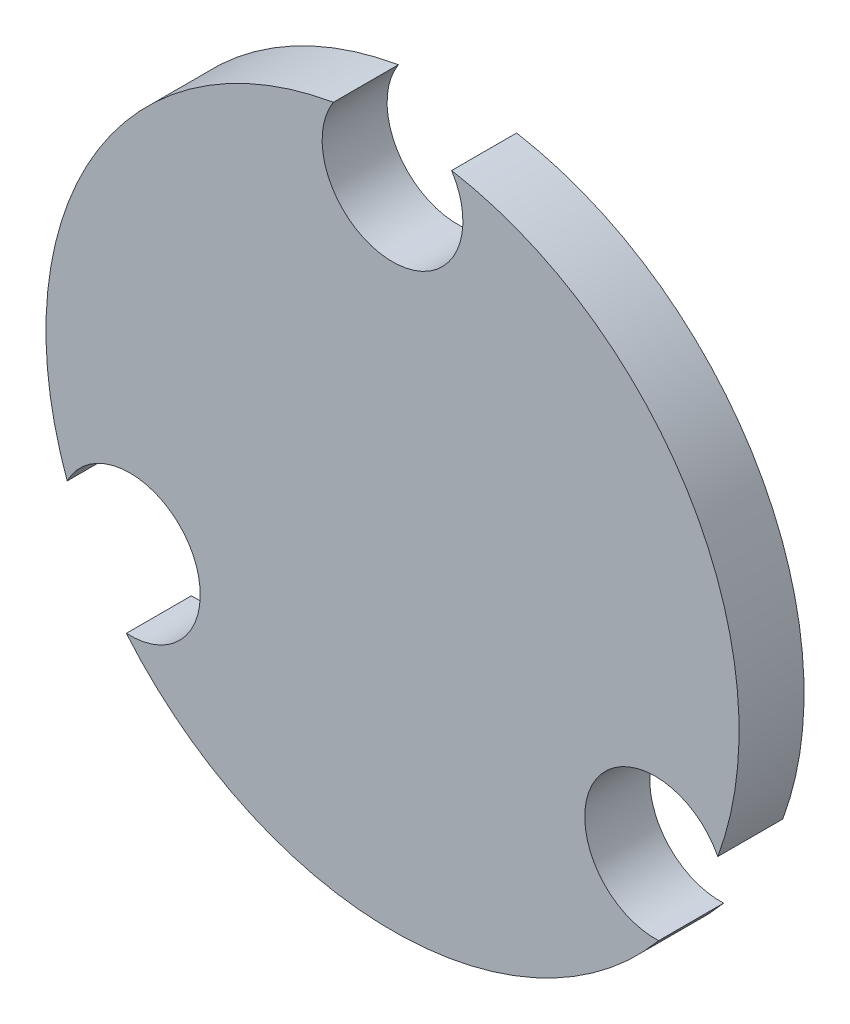
ISO-10303-21;
HEADER;
FILE_DESCRIPTION(('STEP AP214'),'2;1');
FILE_NAME('part.step','',(''),(''),'','','');
FILE_SCHEMA(('AUTOMOTIVE_DESIGN { 1 0 10303 214 1 1 1 1 }'));
ENDSEC;
DATA;
#1=APPLICATION_CONTEXT('core data for automotive mechanical design processes');
#2=APPLICATION_PROTOCOL_DEFINITION('international standard','automotive_design',2000,#1);
#3=PRODUCT_CONTEXT('',#1,'mechanical');
#4=PRODUCT('Part','Part','',(#3));
#5=PRODUCT_RELATED_PRODUCT_CATEGORY('part','',(#4));
#6=PRODUCT_DEFINITION_FORMATION('','',#4);
#7=PRODUCT_DEFINITION_CONTEXT('part definition',#1,'design');
#8=PRODUCT_DEFINITION('design','',#6,#7);
#9=PRODUCT_DEFINITION_SHAPE('','',#8);
#10=(LENGTH_UNIT() NAMED_UNIT(*) SI_UNIT(.MILLI.,.METRE.));
#11=(NAMED_UNIT(*) PLANE_ANGLE_UNIT() SI_UNIT($,.RADIAN.));
#12=(NAMED_UNIT(*) SI_UNIT($,.STERADIAN.) SOLID_ANGLE_UNIT());
#13=UNCERTAINTY_MEASURE_WITH_UNIT(LENGTH_MEASURE(1.E-05),#10,'distance_accuracy_value','');
#14=(GEOMETRIC_REPRESENTATION_CONTEXT(3) GLOBAL_UNCERTAINTY_ASSIGNED_CONTEXT((#13)) GLOBAL_UNIT_ASSIGNED_CONTEXT((#10,
#11,#12)) REPRESENTATION_CONTEXT('',''));
#15=CARTESIAN_POINT('',(0.,0.,0.));
#16=DIRECTION('',(0.,0.,1.));
#17=DIRECTION('',(1.,0.,0.));
#18=AXIS2_PLACEMENT_3D('',#15,#16,#17);
#19=CARTESIAN_POINT('',(0.,0.,3.));
#20=DIRECTION('',(0.,0.,-1.));
#21=DIRECTION('',(-1.,0.,0.));
#22=AXIS2_PLACEMENT_3D('',#19,#20,#21);
#23=CYLINDRICAL_SURFACE('',#22,16.);
#24=CARTESIAN_POINT('',(0.,0.,0.));
#25=DIRECTION('',(0.,0.,1.));
#26=DIRECTION('',(1.,0.,0.));
#27=AXIS2_PLACEMENT_3D('',#24,#25,#26);
#28=CIRCLE('',#27,16.);
#29=CARTESIAN_POINT('',(15.0177143848253,-5.51980567192474,0.));
#30=VERTEX_POINT('',#29);
#31=CARTESIAN_POINT('',(2.72856525657282,15.765625,0.));
#32=VERTEX_POINT('',#31);
#33=EDGE_CURVE('E117',#30,#32,#28,.T.);
#34=ORIENTED_EDGE('',*,*,#33,.T.);
#35=DIRECTION('',(0.,0.,-1.));
#36=VECTOR('',#35,1.);
#37=CARTESIAN_POINT('',(2.72856525657282,15.765625,3.));
#38=LINE('',#37,#36);
#39=CARTESIAN_POINT('',(2.72856525657282,15.765625,3.));
#40=VERTEX_POINT('',#39);
#41=EDGE_CURVE('E11',#40,#32,#38,.T.);
#42=ORIENTED_EDGE('',*,*,#41,.F.);
#43=CARTESIAN_POINT('',(0.,0.,3.));
#44=DIRECTION('',(0.,0.,1.));
#45=DIRECTION('',(1.,0.,0.));
#46=AXIS2_PLACEMENT_3D('',#43,#44,#45);
#47=CIRCLE('',#46,16.);
#48=CARTESIAN_POINT('',(15.0177143848253,-5.51980567192474,3.));
#49=VERTEX_POINT('',#48);
#50=EDGE_CURVE('E127',#49,#40,#47,.T.);
#51=ORIENTED_EDGE('',*,*,#50,.F.);
#52=DIRECTION('',(0.,0.,-1.));
#53=VECTOR('',#52,1.);
#54=CARTESIAN_POINT('',(15.0177143848253,-5.51980567192474,3.));
#55=LINE('',#54,#53);
#56=EDGE_CURVE('E113',#49,#30,#55,.T.);
#57=ORIENTED_EDGE('',*,*,#56,.T.);
#58=EDGE_LOOP('',(#34,#42,#51,#57));
#59=FACE_BOUND('',#58,.T.);
#60=ADVANCED_FACE('F33',(#59),#23,.T.);
#61=CARTESIAN_POINT('',(1.99573676599621E-13,14.,3.));
#62=DIRECTION('',(0.,0.,-1.));
#63=DIRECTION('',(-1.,0.,0.));
#64=AXIS2_PLACEMENT_3D('',#61,#62,#63);
#65=CYLINDRICAL_SURFACE('',#64,3.25000000000001);
#66=CARTESIAN_POINT('',(1.99573676599621E-13,14.,0.));
#67=DIRECTION('',(0.,0.,-1.));
#68=DIRECTION('',(1.,0.,0.));
#69=AXIS2_PLACEMENT_3D('',#66,#67,#68);
#70=CIRCLE('',#69,3.25000000000001);
#71=CARTESIAN_POINT('',(-2.72856525657236,15.765625,0.));
#72=VERTEX_POINT('',#71);
#73=EDGE_CURVE('E120',#32,#72,#70,.T.);
#74=ORIENTED_EDGE('',*,*,#73,.T.);
#75=DIRECTION('',(0.,0.,-1.));
#76=VECTOR('',#75,1.);
#77=CARTESIAN_POINT('',(-2.72856525657236,15.765625,3.));
#78=LINE('',#77,#76);
#79=CARTESIAN_POINT('',(-2.72856525657236,15.765625,3.));
#80=VERTEX_POINT('',#79);
#81=EDGE_CURVE('E41',#80,#72,#78,.T.);
#82=ORIENTED_EDGE('',*,*,#81,.F.);
#83=CARTESIAN_POINT('',(1.99573676599621E-13,14.,3.));
#84=DIRECTION('',(0.,0.,-1.));
#85=DIRECTION('',(1.,0.,0.));
#86=AXIS2_PLACEMENT_3D('',#83,#84,#85);
#87=CIRCLE('',#86,3.25000000000001);
#88=EDGE_CURVE('E86',#40,#80,#87,.T.);
#89=ORIENTED_EDGE('',*,*,#88,.F.);
#90=ORIENTED_EDGE('',*,*,#41,.T.);
#91=EDGE_LOOP('',(#74,#82,#89,#90));
#92=FACE_BOUND('',#91,.T.);
#93=ADVANCED_FACE('F151',(#92),#65,.F.);
#94=CARTESIAN_POINT('',(0.,0.,3.));
#95=DIRECTION('',(0.,0.,-1.));
#96=DIRECTION('',(-1.,0.,0.));
#97=AXIS2_PLACEMENT_3D('',#94,#95,#96);
#98=CYLINDRICAL_SURFACE('',#97,16.);
#99=CARTESIAN_POINT('',(0.,0.,0.));
#100=DIRECTION('',(0.,0.,1.));
#101=DIRECTION('',(1.,0.,0.));
#102=AXIS2_PLACEMENT_3D('',#99,#100,#101);
#103=CIRCLE('',#102,16.);
#104=CARTESIAN_POINT('',(-15.0177449403331,-5.51972253895959,0.));
#105=VERTEX_POINT('',#104);
#106=EDGE_CURVE('E122',#72,#105,#103,.T.);
#107=ORIENTED_EDGE('',*,*,#106,.T.);
#108=DIRECTION('',(0.,0.,-1.));
#109=VECTOR('',#108,1.);
#110=CARTESIAN_POINT('',(-15.0177449403331,-5.51972253895959,3.));
#111=LINE('',#110,#109);
#112=CARTESIAN_POINT('',(-15.0177449403331,-5.51972253895959,3.));
#113=VERTEX_POINT('',#112);
#114=EDGE_CURVE('E108',#113,#105,#111,.T.);
#115=ORIENTED_EDGE('',*,*,#114,.F.);
#116=CARTESIAN_POINT('',(0.,0.,3.));
#117=DIRECTION('',(0.,0.,1.));
#118=DIRECTION('',(1.,0.,0.));
#119=AXIS2_PLACEMENT_3D('',#116,#117,#118);
#120=CIRCLE('',#119,16.);
#121=EDGE_CURVE('E99',#80,#113,#120,.T.);
#122=ORIENTED_EDGE('',*,*,#121,.F.);
#123=ORIENTED_EDGE('',*,*,#81,.T.);
#124=EDGE_LOOP('',(#107,#115,#122,#123));
#125=FACE_BOUND('',#124,.T.);
#126=ADVANCED_FACE('F133',(#125),#98,.T.);
#127=CARTESIAN_POINT('',(-12.1249999999999,-7.00111604177258,3.));
#128=DIRECTION('',(0.,0.,-1.));
#129=DIRECTION('',(-1.,0.,0.));
#130=AXIS2_PLACEMENT_3D('',#127,#128,#129);
#131=CYLINDRICAL_SURFACE('',#130,3.25000000000001);
#132=CARTESIAN_POINT('',(-12.1249999999999,-7.00111604177258,0.));
#133=DIRECTION('',(0.,0.,-1.));
#134=DIRECTION('',(1.,0.,0.));
#135=AXIS2_PLACEMENT_3D('',#132,#133,#134);
#136=CIRCLE('',#135,3.25000000000001);
#137=CARTESIAN_POINT('',(-12.2881493043054,-10.2470184285527,0.));
#138=VERTEX_POINT('',#137);
#139=EDGE_CURVE('E107',#105,#138,#136,.T.);
#140=ORIENTED_EDGE('',*,*,#139,.T.);
#141=DIRECTION('',(0.,0.,-1.));
#142=VECTOR('',#141,1.);
#143=CARTESIAN_POINT('',(-12.2881493043054,-10.2470184285527,3.));
#144=LINE('',#143,#142);
#145=CARTESIAN_POINT('',(-12.2881493043054,-10.2470184285527,3.));
#146=VERTEX_POINT('',#145);
#147=EDGE_CURVE('E104',#146,#138,#144,.T.);
#148=ORIENTED_EDGE('',*,*,#147,.F.);
#149=CARTESIAN_POINT('',(-12.1249999999999,-7.00111604177258,3.));
#150=DIRECTION('',(0.,0.,-1.));
#151=DIRECTION('',(1.,0.,0.));
#152=AXIS2_PLACEMENT_3D('',#149,#150,#151);
#153=CIRCLE('',#152,3.25000000000001);
#154=EDGE_CURVE('E93',#113,#146,#153,.T.);
#155=ORIENTED_EDGE('',*,*,#154,.F.);
#156=ORIENTED_EDGE('',*,*,#114,.T.);
#157=EDGE_LOOP('',(#140,#148,#155,#156));
#158=FACE_BOUND('',#157,.T.);
#159=ADVANCED_FACE('F105',(#158),#131,.F.);
#160=CARTESIAN_POINT('',(0.,0.,3.));
#161=DIRECTION('',(0.,0.,-1.));
#162=DIRECTION('',(-1.,0.,0.));
#163=AXIS2_PLACEMENT_3D('',#160,#161,#162);
#164=CYLINDRICAL_SURFACE('',#163,16.);
#165=CARTESIAN_POINT('',(0.,0.,0.));
#166=DIRECTION('',(0.,0.,1.));
#167=DIRECTION('',(1.,0.,0.));
#168=AXIS2_PLACEMENT_3D('',#165,#166,#167);
#169=CIRCLE('',#168,16.);
#170=CARTESIAN_POINT('',(12.2891491282526,-10.2458193280756,0.));
#171=VERTEX_POINT('',#170);
#172=EDGE_CURVE('E72',#138,#171,#169,.T.);
#173=ORIENTED_EDGE('',*,*,#172,.T.);
#174=DIRECTION('',(0.,0.,-1.));
#175=VECTOR('',#174,1.);
#176=CARTESIAN_POINT('',(12.2891491282526,-10.2458193280756,3.));
#177=LINE('',#176,#175);
#178=CARTESIAN_POINT('',(12.2891491282526,-10.2458193280756,3.));
#179=VERTEX_POINT('',#178);
#180=EDGE_CURVE('E109',#179,#171,#177,.T.);
#181=ORIENTED_EDGE('',*,*,#180,.F.);
#182=CARTESIAN_POINT('',(0.,0.,3.));
#183=DIRECTION('',(0.,0.,1.));
#184=DIRECTION('',(1.,0.,0.));
#185=AXIS2_PLACEMENT_3D('',#182,#183,#184);
#186=CIRCLE('',#185,16.);
#187=EDGE_CURVE('E97',#146,#179,#186,.T.);
#188=ORIENTED_EDGE('',*,*,#187,.F.);
#189=ORIENTED_EDGE('',*,*,#147,.T.);
#190=EDGE_LOOP('',(#173,#181,#188,#189));
#191=FACE_BOUND('',#190,.T.);
#192=ADVANCED_FACE('F111',(#191),#164,.T.);
#193=CARTESIAN_POINT('',(12.124355652982,-7.00000000000017,3.));
#194=DIRECTION('',(0.,0.,-1.));
#195=DIRECTION('',(-1.,0.,0.));
#196=AXIS2_PLACEMENT_3D('',#193,#194,#195);
#197=CYLINDRICAL_SURFACE('',#196,3.25);
#198=CARTESIAN_POINT('',(12.124355652982,-7.00000000000017,0.));
#199=DIRECTION('',(0.,0.,-1.));
#200=DIRECTION('',(1.,0.,0.));
#201=AXIS2_PLACEMENT_3D('',#198,#199,#200);
#202=CIRCLE('',#201,3.25);
#203=EDGE_CURVE('E78',#171,#30,#202,.T.);
#204=ORIENTED_EDGE('',*,*,#203,.T.);
#205=ORIENTED_EDGE('',*,*,#56,.F.);
#206=CARTESIAN_POINT('',(12.124355652982,-7.00000000000017,3.));
#207=DIRECTION('',(0.,0.,-1.));
#208=DIRECTION('',(1.,0.,0.));
#209=AXIS2_PLACEMENT_3D('',#206,#207,#208);
#210=CIRCLE('',#209,3.25);
#211=EDGE_CURVE('E49',#179,#49,#210,.T.);
#212=ORIENTED_EDGE('',*,*,#211,.F.);
#213=ORIENTED_EDGE('',*,*,#180,.T.);
#214=EDGE_LOOP('',(#204,#205,#212,#213));
#215=FACE_BOUND('',#214,.T.);
#216=ADVANCED_FACE('F140',(#215),#197,.F.);
#217=CARTESIAN_POINT('',(0.,7.,3.));
#218=DIRECTION('',(0.,0.,1.));
#219=DIRECTION('',(1.,0.,0.));
#220=AXIS2_PLACEMENT_3D('',#217,#218,#219);
#221=PLANE('',#220);
#222=ORIENTED_EDGE('',*,*,#50,.T.);
#223=ORIENTED_EDGE('',*,*,#88,.T.);
#224=ORIENTED_EDGE('',*,*,#121,.T.);
#225=ORIENTED_EDGE('',*,*,#154,.T.);
#226=ORIENTED_EDGE('',*,*,#187,.T.);
#227=ORIENTED_EDGE('',*,*,#211,.T.);
#228=EDGE_LOOP('',(#222,#223,#224,#225,#226,#227));
#229=FACE_BOUND('',#228,.T.);
#230=ADVANCED_FACE('F95',(#229),#221,.T.);
#231=CARTESIAN_POINT('',(0.,7.,0.));
#232=DIRECTION('',(0.,0.,1.));
#233=DIRECTION('',(1.,0.,0.));
#234=AXIS2_PLACEMENT_3D('',#231,#232,#233);
#235=PLANE('',#234);
#236=ORIENTED_EDGE('',*,*,#33,.F.);
#237=ORIENTED_EDGE('',*,*,#203,.F.);
#238=ORIENTED_EDGE('',*,*,#172,.F.);
#239=ORIENTED_EDGE('',*,*,#139,.F.);
#240=ORIENTED_EDGE('',*,*,#106,.F.);
#241=ORIENTED_EDGE('',*,*,#73,.F.);
#242=EDGE_LOOP('',(#236,#237,#238,#239,#240,#241));
#243=FACE_BOUND('',#242,.T.);
#244=ADVANCED_FACE('F136',(#243),#235,.F.);
#245=CLOSED_SHELL('',(#60,#93,#126,#159,#192,#216,#230,#244));
#246=MANIFOLD_SOLID_BREP('B2',#245);
#247=ADVANCED_BREP_SHAPE_REPRESENTATION('',(#18,#246),#14);
#248=SHAPE_DEFINITION_REPRESENTATION(#9,#247);
ENDSEC;
END-ISO-10303-21;
